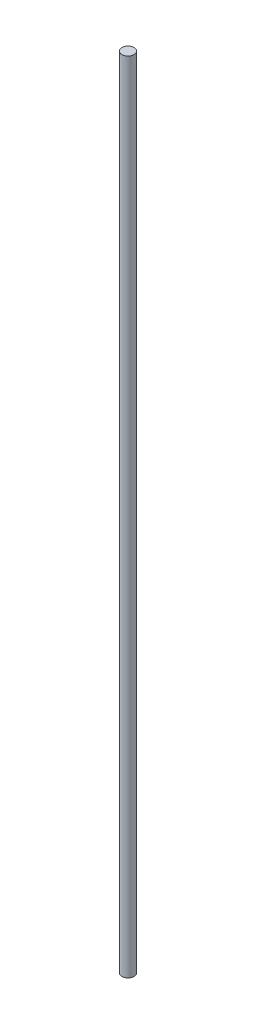
ISO-10303-21;
HEADER;
FILE_DESCRIPTION(('STEP AP214'),'2;1');
FILE_NAME('part.step','',(''),(''),'','','');
FILE_SCHEMA(('AUTOMOTIVE_DESIGN { 1 0 10303 214 1 1 1 1 }'));
ENDSEC;
DATA;
#1=APPLICATION_CONTEXT('core data for automotive mechanical design processes');
#2=APPLICATION_PROTOCOL_DEFINITION('international standard','automotive_design',2000,#1);
#3=PRODUCT_CONTEXT('',#1,'mechanical');
#4=PRODUCT('Part','Part','',(#3));
#5=PRODUCT_RELATED_PRODUCT_CATEGORY('part','',(#4));
#6=PRODUCT_DEFINITION_FORMATION('','',#4);
#7=PRODUCT_DEFINITION_CONTEXT('part definition',#1,'design');
#8=PRODUCT_DEFINITION('design','',#6,#7);
#9=PRODUCT_DEFINITION_SHAPE('','',#8);
#10=(LENGTH_UNIT() NAMED_UNIT(*) SI_UNIT(.MILLI.,.METRE.));
#11=(NAMED_UNIT(*) PLANE_ANGLE_UNIT() SI_UNIT($,.RADIAN.));
#12=(NAMED_UNIT(*) SI_UNIT($,.STERADIAN.) SOLID_ANGLE_UNIT());
#13=UNCERTAINTY_MEASURE_WITH_UNIT(LENGTH_MEASURE(1.E-05),#10,'distance_accuracy_value','');
#14=(GEOMETRIC_REPRESENTATION_CONTEXT(3) GLOBAL_UNCERTAINTY_ASSIGNED_CONTEXT((#13)) GLOBAL_UNIT_ASSIGNED_CONTEXT((#10,
#11,#12)) REPRESENTATION_CONTEXT('',''));
#15=CARTESIAN_POINT('',(0.,0.,0.));
#16=DIRECTION('',(0.,0.,1.));
#17=DIRECTION('',(1.,0.,0.));
#18=AXIS2_PLACEMENT_3D('',#15,#16,#17);
#19=CARTESIAN_POINT('',(0.,309.88,0.));
#20=DIRECTION('',(0.,-1.,0.));
#21=DIRECTION('',(0.,0.,-1.));
#22=AXIS2_PLACEMENT_3D('',#19,#20,#21);
#23=CYLINDRICAL_SURFACE('',#22,2.38125);
#24=CARTESIAN_POINT('',(0.,309.88,0.));
#25=DIRECTION('',(0.,1.,0.));
#26=DIRECTION('',(0.,0.,1.));
#27=AXIS2_PLACEMENT_3D('',#24,#25,#26);
#28=CIRCLE('',#27,2.38125);
#29=CARTESIAN_POINT('',(0.,309.88,2.38125));
#30=VERTEX_POINT('',#29);
#31=EDGE_CURVE('E10',#30,#30,#28,.T.);
#32=ORIENTED_EDGE('',*,*,#31,.F.);
#33=EDGE_LOOP('',(#32));
#34=FACE_BOUND('',#33,.T.);
#35=CARTESIAN_POINT('',(0.,0.,0.));
#36=DIRECTION('',(0.,1.,0.));
#37=DIRECTION('',(0.,0.,1.));
#38=AXIS2_PLACEMENT_3D('',#35,#36,#37);
#39=CIRCLE('',#38,2.38125);
#40=CARTESIAN_POINT('',(0.,0.,2.38125));
#41=VERTEX_POINT('',#40);
#42=EDGE_CURVE('E34',#41,#41,#39,.T.);
#43=ORIENTED_EDGE('',*,*,#42,.T.);
#44=EDGE_LOOP('',(#43));
#45=FACE_BOUND('',#44,.T.);
#46=ADVANCED_FACE('F31',(#34,#45),#23,.T.);
#47=CARTESIAN_POINT('',(0.,309.88,0.));
#48=DIRECTION('',(0.,1.,0.));
#49=DIRECTION('',(0.,0.,1.));
#50=AXIS2_PLACEMENT_3D('',#47,#48,#49);
#51=PLANE('',#50);
#52=ORIENTED_EDGE('',*,*,#31,.T.);
#53=EDGE_LOOP('',(#52));
#54=FACE_BOUND('',#53,.T.);
#55=ADVANCED_FACE('F46',(#54),#51,.T.);
#56=CARTESIAN_POINT('',(0.,0.,0.));
#57=DIRECTION('',(0.,1.,0.));
#58=DIRECTION('',(0.,0.,1.));
#59=AXIS2_PLACEMENT_3D('',#56,#57,#58);
#60=PLANE('',#59);
#61=ORIENTED_EDGE('',*,*,#42,.F.);
#62=EDGE_LOOP('',(#61));
#63=FACE_BOUND('',#62,.T.);
#64=ADVANCED_FACE('F44',(#63),#60,.F.);
#65=CLOSED_SHELL('',(#46,#55,#64));
#66=MANIFOLD_SOLID_BREP('B2',#65);
#67=ADVANCED_BREP_SHAPE_REPRESENTATION('',(#18,#66),#14);
#68=SHAPE_DEFINITION_REPRESENTATION(#9,#67);
ENDSEC;
END-ISO-10303-21;
